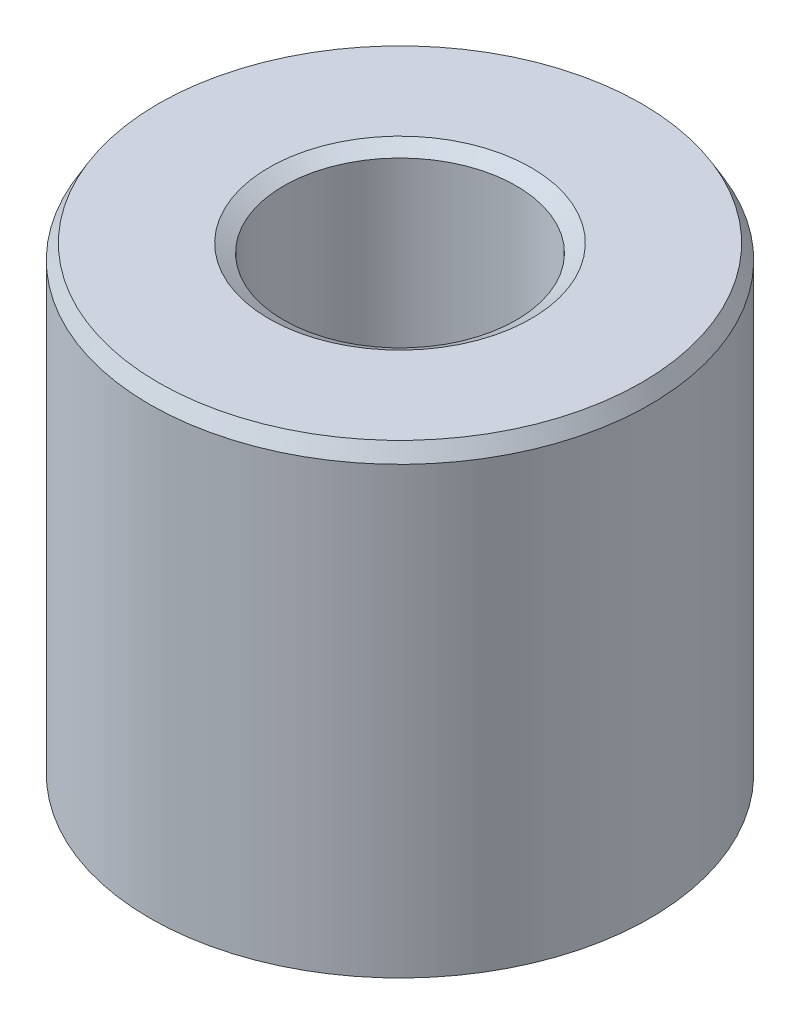
ISO-10303-21;
HEADER;
FILE_DESCRIPTION(('STEP AP214'),'2;1');
FILE_NAME('part.step','',(''),(''),'','','');
FILE_SCHEMA(('AUTOMOTIVE_DESIGN { 1 0 10303 214 1 1 1 1 }'));
ENDSEC;
DATA;
#1=APPLICATION_CONTEXT('core data for automotive mechanical design processes');
#2=APPLICATION_PROTOCOL_DEFINITION('international standard','automotive_design',2000,#1);
#3=PRODUCT_CONTEXT('',#1,'mechanical');
#4=PRODUCT('Part','Part','',(#3));
#5=PRODUCT_RELATED_PRODUCT_CATEGORY('part','',(#4));
#6=PRODUCT_DEFINITION_FORMATION('','',#4);
#7=PRODUCT_DEFINITION_CONTEXT('part definition',#1,'design');
#8=PRODUCT_DEFINITION('design','',#6,#7);
#9=PRODUCT_DEFINITION_SHAPE('','',#8);
#10=(LENGTH_UNIT() NAMED_UNIT(*) SI_UNIT(.MILLI.,.METRE.));
#11=(NAMED_UNIT(*) PLANE_ANGLE_UNIT() SI_UNIT($,.RADIAN.));
#12=(NAMED_UNIT(*) SI_UNIT($,.STERADIAN.) SOLID_ANGLE_UNIT());
#13=UNCERTAINTY_MEASURE_WITH_UNIT(LENGTH_MEASURE(1.E-05),#10,'distance_accuracy_value','');
#14=(GEOMETRIC_REPRESENTATION_CONTEXT(3) GLOBAL_UNCERTAINTY_ASSIGNED_CONTEXT((#13)) GLOBAL_UNIT_ASSIGNED_CONTEXT((#10,
#11,#12)) REPRESENTATION_CONTEXT('',''));
#15=CARTESIAN_POINT('',(0.,0.,0.));
#16=DIRECTION('',(0.,0.,1.));
#17=DIRECTION('',(1.,0.,0.));
#18=AXIS2_PLACEMENT_3D('',#15,#16,#17);
#19=CARTESIAN_POINT('',(0.,74.8606184979208,0.));
#20=DIRECTION('',(0.,-1.,0.));
#21=DIRECTION('',(0.,0.,-1.));
#22=AXIS2_PLACEMENT_3D('',#19,#20,#21);
#23=CYLINDRICAL_SURFACE('',#22,40.);
#24=CARTESIAN_POINT('',(0.,1.3616517794041,0.));
#25=DIRECTION('',(0.,1.,0.));
#26=DIRECTION('',(0.,0.,1.));
#27=AXIS2_PLACEMENT_3D('',#24,#25,#26);
#28=CIRCLE('',#27,40.);
#29=CARTESIAN_POINT('',(0.,1.3616517794041,40.));
#30=VERTEX_POINT('',#29);
#31=EDGE_CURVE('E10',#30,#30,#28,.T.);
#32=ORIENTED_EDGE('',*,*,#31,.T.);
#33=EDGE_LOOP('',(#32));
#34=FACE_BOUND('',#33,.T.);
#35=CARTESIAN_POINT('',(0.,72.5021684337763,0.));
#36=DIRECTION('',(0.,1.,0.));
#37=DIRECTION('',(0.,0.,1.));
#38=AXIS2_PLACEMENT_3D('',#35,#36,#37);
#39=CIRCLE('',#38,40.);
#40=CARTESIAN_POINT('',(0.,72.5021684337763,40.));
#41=VERTEX_POINT('',#40);
#42=EDGE_CURVE('E50',#41,#41,#39,.F.);
#43=ORIENTED_EDGE('',*,*,#42,.T.);
#44=EDGE_LOOP('',(#43));
#45=FACE_BOUND('',#44,.T.);
#46=ADVANCED_FACE('F39',(#34,#45),#23,.T.);
#47=CARTESIAN_POINT('',(0.,74.8606184979208,0.));
#48=DIRECTION('',(0.,1.,0.));
#49=DIRECTION('',(0.,0.,1.));
#50=AXIS2_PLACEMENT_3D('',#47,#48,#49);
#51=PLANE('',#50);
#52=CARTESIAN_POINT('',(0.,74.8606184979208,0.));
#53=DIRECTION('',(0.,1.,0.));
#54=DIRECTION('',(0.,0.,1.));
#55=AXIS2_PLACEMENT_3D('',#52,#53,#54);
#56=CIRCLE('',#55,20.9595914073997);
#57=CARTESIAN_POINT('',(0.,74.8606184979208,20.9595914073997));
#58=VERTEX_POINT('',#57);
#59=EDGE_CURVE('E58',#58,#58,#56,.F.);
#60=ORIENTED_EDGE('',*,*,#59,.T.);
#61=EDGE_LOOP('',(#60));
#62=FACE_BOUND('',#61,.T.);
#63=CARTESIAN_POINT('',(0.,74.8606184979208,0.));
#64=DIRECTION('',(0.,1.,0.));
#65=DIRECTION('',(0.,0.,1.));
#66=AXIS2_PLACEMENT_3D('',#63,#64,#65);
#67=CIRCLE('',#66,38.6383482205959);
#68=CARTESIAN_POINT('',(0.,74.8606184979208,38.6383482205959));
#69=VERTEX_POINT('',#68);
#70=EDGE_CURVE('E61',#69,#69,#67,.T.);
#71=ORIENTED_EDGE('',*,*,#70,.T.);
#72=EDGE_LOOP('',(#71));
#73=FACE_BOUND('',#72,.T.);
#74=ADVANCED_FACE('F88',(#62,#73),#51,.T.);
#75=CARTESIAN_POINT('',(0.,0.,0.));
#76=DIRECTION('',(0.,1.,0.));
#77=DIRECTION('',(0.,0.,1.));
#78=AXIS2_PLACEMENT_3D('',#75,#76,#77);
#79=PLANE('',#78);
#80=CARTESIAN_POINT('',(0.,0.,0.));
#81=DIRECTION('',(0.,1.,0.));
#82=DIRECTION('',(0.,0.,1.));
#83=AXIS2_PLACEMENT_3D('',#80,#81,#82);
#84=CIRCLE('',#83,19.9627931226593);
#85=CARTESIAN_POINT('',(0.,0.,19.9627931226593));
#86=VERTEX_POINT('',#85);
#87=EDGE_CURVE('E51',#86,#86,#84,.T.);
#88=ORIENTED_EDGE('',*,*,#87,.T.);
#89=EDGE_LOOP('',(#88));
#90=FACE_BOUND('',#89,.T.);
#91=CARTESIAN_POINT('',(0.,0.,0.));
#92=DIRECTION('',(0.,1.,0.));
#93=DIRECTION('',(0.,0.,1.));
#94=AXIS2_PLACEMENT_3D('',#91,#92,#93);
#95=CIRCLE('',#94,37.6415499358555);
#96=CARTESIAN_POINT('',(0.,0.,37.6415499358555));
#97=VERTEX_POINT('',#96);
#98=EDGE_CURVE('E54',#97,#97,#95,.F.);
#99=ORIENTED_EDGE('',*,*,#98,.T.);
#100=EDGE_LOOP('',(#99));
#101=FACE_BOUND('',#100,.T.);
#102=ADVANCED_FACE('F83',(#90,#101),#79,.F.);
#103=CARTESIAN_POINT('',(0.,74.8606184979208,0.));
#104=DIRECTION('',(0.,-1.,0.));
#105=DIRECTION('',(0.,0.,-1.));
#106=AXIS2_PLACEMENT_3D('',#103,#104,#105);
#107=CYLINDRICAL_SURFACE('',#106,18.6011413432552);
#108=CARTESIAN_POINT('',(0.,73.4989667185167,0.));
#109=DIRECTION('',(0.,1.,0.));
#110=DIRECTION('',(0.,0.,1.));
#111=AXIS2_PLACEMENT_3D('',#108,#109,#110);
#112=CIRCLE('',#111,18.6011413432552);
#113=CARTESIAN_POINT('',(0.,73.4989667185167,18.6011413432552));
#114=VERTEX_POINT('',#113);
#115=EDGE_CURVE('E67',#114,#114,#112,.T.);
#116=ORIENTED_EDGE('',*,*,#115,.T.);
#117=EDGE_LOOP('',(#116));
#118=FACE_BOUND('',#117,.T.);
#119=CARTESIAN_POINT('',(0.,2.35845006414447,0.));
#120=DIRECTION('',(0.,1.,0.));
#121=DIRECTION('',(0.,0.,1.));
#122=AXIS2_PLACEMENT_3D('',#119,#120,#121);
#123=CIRCLE('',#122,18.6011413432552);
#124=CARTESIAN_POINT('',(0.,2.35845006414447,18.6011413432552));
#125=VERTEX_POINT('',#124);
#126=EDGE_CURVE('E69',#125,#125,#123,.F.);
#127=ORIENTED_EDGE('',*,*,#126,.T.);
#128=EDGE_LOOP('',(#127));
#129=FACE_BOUND('',#128,.T.);
#130=ADVANCED_FACE('F71',(#118,#129),#107,.F.);
#131=CARTESIAN_POINT('',(0.,73.4989667185167,0.));
#132=DIRECTION('',(0.,1.,0.));
#133=DIRECTION('',(0.,0.,1.));
#134=AXIS2_PLACEMENT_3D('',#131,#132,#133);
#135=CONICAL_SURFACE('',#134,18.6011413432552,1.0471975511966);
#136=CARTESIAN_POINT('',(0.,74.8606184979208,20.9595914073997));
#137=CARTESIAN_POINT('',(0.,74.8464346252187,20.9350242192316));
#138=CARTESIAN_POINT('',(0.,74.8322507525166,20.9104570310634));
#139=CARTESIAN_POINT('',(0.,74.8038830071123,20.861322654727));
#140=CARTESIAN_POINT('',(0.,74.7896991344102,20.8367554665589));
#141=CARTESIAN_POINT('',(0.,74.7613313890059,20.7876210902225));
#142=CARTESIAN_POINT('',(0.,74.7471475163038,20.7630539020544));
#143=CARTESIAN_POINT('',(0.,74.7187797708995,20.713919525718));
#144=CARTESIAN_POINT('',(0.,74.7045958981974,20.6893523375498));
#145=CARTESIAN_POINT('',(0.,74.6762281527932,20.6402179612135));
#146=CARTESIAN_POINT('',(0.,74.6620442800911,20.6156507730453));
#147=CARTESIAN_POINT('',(0.,74.6336765346868,20.566516396709));
#148=CARTESIAN_POINT('',(0.,74.6194926619847,20.5419492085408));
#149=CARTESIAN_POINT('',(0.,74.5911249165804,20.4928148322045));
#150=CARTESIAN_POINT('',(0.,74.5769410438783,20.4682476440363));
#151=CARTESIAN_POINT('',(0.,74.548573298474,20.4191132676999));
#152=CARTESIAN_POINT('',(0.,74.5343894257719,20.3945460795318));
#153=CARTESIAN_POINT('',(0.,74.5060216803677,20.3454117031954));
#154=CARTESIAN_POINT('',(0.,74.4918378076655,20.3208445150273));
#155=CARTESIAN_POINT('',(0.,74.4634700622613,20.2717101386909));
#156=CARTESIAN_POINT('',(0.,74.4492861895591,20.2471429505227));
#157=CARTESIAN_POINT('',(0.,74.4209184441549,20.1980085741864));
#158=CARTESIAN_POINT('',(0.,74.4067345714528,20.1734413860182));
#159=CARTESIAN_POINT('',(0.,74.3783668260485,20.1243070096819));
#160=CARTESIAN_POINT('',(0.,74.3641829533464,20.0997398215137));
#161=CARTESIAN_POINT('',(0.,74.3358152079421,20.0506054451774));
#162=CARTESIAN_POINT('',(0.,74.32163133524,20.0260382570092));
#163=CARTESIAN_POINT('',(0.,74.2932635898358,19.9769038806729));
#164=CARTESIAN_POINT('',(0.,74.2790797171337,19.9523366925047));
#165=CARTESIAN_POINT('',(0.,74.2507119717294,19.9032023161683));
#166=CARTESIAN_POINT('',(0.,74.2365280990273,19.8786351280002));
#167=CARTESIAN_POINT('',(0.,74.208160353623,19.8295007516638));
#168=CARTESIAN_POINT('',(0.,74.1939764809209,19.8049335634956));
#169=CARTESIAN_POINT('',(0.,74.1656087355166,19.7557991871593));
#170=CARTESIAN_POINT('',(0.,74.1514248628145,19.7312319989911));
#171=CARTESIAN_POINT('',(0.,74.1230571174103,19.6820976226548));
#172=CARTESIAN_POINT('',(0.,74.1088732447081,19.6575304344866));
#173=CARTESIAN_POINT('',(0.,74.0805054993039,19.6083960581503));
#174=CARTESIAN_POINT('',(0.,74.0663216266017,19.5838288699821));
#175=CARTESIAN_POINT('',(0.,74.0379538811975,19.5346944936458));
#176=CARTESIAN_POINT('',(0.,74.0237700084954,19.5101273054776));
#177=CARTESIAN_POINT('',(0.,73.9954022630911,19.4609929291412));
#178=CARTESIAN_POINT('',(0.,73.981218390389,19.4364257409731));
#179=CARTESIAN_POINT('',(0.,73.9528506449847,19.3872913646367));
#180=CARTESIAN_POINT('',(0.,73.9386667722826,19.3627241764686));
#181=CARTESIAN_POINT('',(0.,73.9102990268784,19.3135898001322));
#182=CARTESIAN_POINT('',(0.,73.8961151541762,19.289022611964));
#183=CARTESIAN_POINT('',(0.,73.867747408772,19.2398882356277));
#184=CARTESIAN_POINT('',(0.,73.8535635360699,19.2153210474595));
#185=CARTESIAN_POINT('',(0.,73.8251957906656,19.1661866711232));
#186=CARTESIAN_POINT('',(0.,73.8110119179635,19.141619482955));
#187=CARTESIAN_POINT('',(0.,73.7826441725592,19.0924851066187));
#188=CARTESIAN_POINT('',(0.,73.7684602998571,19.0679179184505));
#189=CARTESIAN_POINT('',(0.,73.7400925544529,19.0187835421142));
#190=CARTESIAN_POINT('',(0.,73.7259086817507,18.994216353946));
#191=CARTESIAN_POINT('',(0.,73.6975409363465,18.9450819776096));
#192=CARTESIAN_POINT('',(0.,73.6833570636444,18.9205147894415));
#193=CARTESIAN_POINT('',(0.,73.6549893182401,18.8713804131051));
#194=CARTESIAN_POINT('',(0.,73.640805445538,18.8468132249369));
#195=CARTESIAN_POINT('',(0.,73.6124377001337,18.7976788486006));
#196=CARTESIAN_POINT('',(0.,73.5982538274316,18.7731116604324));
#197=CARTESIAN_POINT('',(0.,73.5698860820273,18.7239772840961));
#198=CARTESIAN_POINT('',(0.,73.5557022093252,18.6994100959279));
#199=CARTESIAN_POINT('',(0.,73.527334463921,18.6502757195916));
#200=CARTESIAN_POINT('',(0.,73.5131505912188,18.6257085314234));
#201=CARTESIAN_POINT('',(0.,73.4989667185167,18.6011413432552));
#202=B_SPLINE_CURVE_WITH_KNOTS('',3,(#136,#137,#138,#139,#140,#141,#142,#143,#144,#145,#146,
#147,#148,#149,#150,#151,#152,#153,#154,#155,#156,#157,#158,#159,#160,#161,#162,#163,#164,#165,
#166,#167,#168,#169,#170,#171,#172,#173,#174,#175,#176,#177,#178,#179,#180,#181,#182,#183,#184,
#185,#186,#187,#188,#189,#190,#191,#192,#193,#194,#195,#196,#197,#198,#199,#200,#201),
.UNSPECIFIED.,.F.,.F.,(4,2,2,2,2,2,2,2,2,2,2,2,2,2,2,2,2,2,2,2,2,2,2,2,2,2,2,2,2,2,2,2,4),(0.,
0.0851032362127611,0.170206472425518,0.255309708638279,0.340412944851034,0.425516181063788,
0.510619417276549,0.595722653489303,0.680825889702057,0.765929125914821,0.851032362127575,
0.936135598340329,1.02123883455309,1.10634207076584,1.1914453069786,1.27654854319136,
1.36165177940412,1.44675501561687,1.53185825182963,1.61696148804239,1.70206472425514,
1.7871679604679,1.87227119668066,1.95737443289341,2.04247766910617,2.12758090531893,
2.21268414153169,2.29778737774445,2.3828906139572,2.46799385016996,2.55309708638272,
2.63820032259547,2.72330355880823),.UNSPECIFIED.);
#203=EDGE_CURVE('BSEAM77',#58,#114,#202,.T.);
#204=ORIENTED_EDGE('',*,*,#59,.F.);
#205=ORIENTED_EDGE('',*,*,#115,.F.);
#206=ORIENTED_EDGE('',*,*,#203,.T.);
#207=ORIENTED_EDGE('',*,*,#203,.F.);
#208=EDGE_LOOP('',(#204,#206,#205,#207));
#209=FACE_BOUND('',#208,.T.);
#210=ADVANCED_FACE('F77',(#209),#135,.F.);
#211=CARTESIAN_POINT('',(0.,0.,0.));
#212=DIRECTION('',(0.,-1.,0.));
#213=DIRECTION('',(0.,0.,-1.));
#214=AXIS2_PLACEMENT_3D('',#211,#212,#213);
#215=CONICAL_SURFACE('',#214,19.9627931226593,0.523598775598299);
#216=ORIENTED_EDGE('',*,*,#126,.F.);
#217=EDGE_LOOP('',(#216));
#218=FACE_BOUND('',#217,.T.);
#219=ORIENTED_EDGE('',*,*,#87,.F.);
#220=EDGE_LOOP('',(#219));
#221=FACE_BOUND('',#220,.T.);
#222=ADVANCED_FACE('F73',(#218,#221),#215,.F.);
#223=CARTESIAN_POINT('',(0.,1.3616517794041,0.));
#224=DIRECTION('',(0.,1.,0.));
#225=DIRECTION('',(0.,0.,1.));
#226=AXIS2_PLACEMENT_3D('',#223,#224,#225);
#227=CONICAL_SURFACE('',#226,40.,1.0471975511966);
#228=CARTESIAN_POINT('',(0.,0.,37.6415499358555));
#229=CARTESIAN_POINT('',(0.,0.0141838727021258,37.6661171240237));
#230=CARTESIAN_POINT('',(0.,0.0283677454042519,37.6906843121919));
#231=CARTESIAN_POINT('',(0.,0.056735490808504,37.7398186885282));
#232=CARTESIAN_POINT('',(0.,0.0709193635106301,37.7643858766964));
#233=CARTESIAN_POINT('',(0.,0.0992871089148822,37.8135202530327));
#234=CARTESIAN_POINT('',(0.,0.113470981617008,37.8380874412009));
#235=CARTESIAN_POINT('',(0.,0.14183872702126,37.8872218175372));
#236=CARTESIAN_POINT('',(0.,0.156022599723387,37.9117890057054));
#237=CARTESIAN_POINT('',(0.,0.184390345127639,37.9609233820418));
#238=CARTESIAN_POINT('',(0.,0.198574217829765,37.9854905702099));
#239=CARTESIAN_POINT('',(0.,0.226941963234017,38.0346249465463));
#240=CARTESIAN_POINT('',(0.,0.241125835936143,38.0591921347144));
#241=CARTESIAN_POINT('',(0.,0.269493581340395,38.1083265110508));
#242=CARTESIAN_POINT('',(0.,0.283677454042521,38.132893699219));
#243=CARTESIAN_POINT('',(0.,0.312045199446773,38.1820280755553));
#244=CARTESIAN_POINT('',(0.,0.326229072148899,38.2065952637235));
#245=CARTESIAN_POINT('',(0.,0.354596817553151,38.2557296400598));
#246=CARTESIAN_POINT('',(0.,0.368780690255277,38.280296828228));
#247=CARTESIAN_POINT('',(0.,0.39714843565953,38.3294312045643));
#248=CARTESIAN_POINT('',(0.,0.411332308361656,38.3539983927325));
#249=CARTESIAN_POINT('',(0.,0.439700053765908,38.4031327690688));
#250=CARTESIAN_POINT('',(0.,0.453883926468034,38.427699957237));
#251=CARTESIAN_POINT('',(0.,0.482251671872286,38.4768343335734));
#252=CARTESIAN_POINT('',(0.,0.496435544574411,38.5014015217415));
#253=CARTESIAN_POINT('',(0.,0.524803289978664,38.5505358980779));
#254=CARTESIAN_POINT('',(0.,0.538987162680791,38.575103086246));
#255=CARTESIAN_POINT('',(0.,0.567354908085043,38.6242374625824));
#256=CARTESIAN_POINT('',(0.,0.581538780787169,38.6488046507506));
#257=CARTESIAN_POINT('',(0.,0.60990652619142,38.6979390270869));
#258=CARTESIAN_POINT('',(0.,0.624090398893547,38.7225062152551));
#259=CARTESIAN_POINT('',(0.,0.652458144297799,38.7716405915914));
#260=CARTESIAN_POINT('',(0.,0.666642016999925,38.7962077797596));
#261=CARTESIAN_POINT('',(0.,0.695009762404177,38.8453421560959));
#262=CARTESIAN_POINT('',(0.,0.709193635106303,38.8699093442641));
#263=CARTESIAN_POINT('',(0.,0.737561380510555,38.9190437206004));
#264=CARTESIAN_POINT('',(0.,0.751745253212681,38.9436109087686));
#265=CARTESIAN_POINT('',(0.,0.780112998616933,38.992745285105));
#266=CARTESIAN_POINT('',(0.,0.794296871319059,39.0173124732731));
#267=CARTESIAN_POINT('',(0.,0.822664616723311,39.0664468496095));
#268=CARTESIAN_POINT('',(0.,0.836848489425438,39.0910140377776));
#269=CARTESIAN_POINT('',(0.,0.86521623482969,39.140148414114));
#270=CARTESIAN_POINT('',(0.,0.879400107531816,39.1647156022822));
#271=CARTESIAN_POINT('',(0.,0.907767852936068,39.2138499786185));
#272=CARTESIAN_POINT('',(0.,0.921951725638194,39.2384171667867));
#273=CARTESIAN_POINT('',(0.,0.950319471042446,39.287551543123));
#274=CARTESIAN_POINT('',(0.,0.964503343744572,39.3121187312912));
#275=CARTESIAN_POINT('',(0.,0.992871089148824,39.3612531076275));
#276=CARTESIAN_POINT('',(0.,1.00705496185095,39.3858202957957));
#277=CARTESIAN_POINT('',(0.,1.0354227072552,39.4349546721321));
#278=CARTESIAN_POINT('',(0.,1.04960657995733,39.4595218603002));
#279=CARTESIAN_POINT('',(0.,1.07797432536158,39.5086562366366));
#280=CARTESIAN_POINT('',(0.,1.09215819806371,39.5332234248047));
#281=CARTESIAN_POINT('',(0.,1.12052594346796,39.5823578011411));
#282=CARTESIAN_POINT('',(0.,1.13470981617008,39.6069249893093));
#283=CARTESIAN_POINT('',(0.,1.16307756157434,39.6560593656456));
#284=CARTESIAN_POINT('',(0.,1.17726143427646,39.6806265538138));
#285=CARTESIAN_POINT('',(0.,1.20562917968072,39.7297609301501));
#286=CARTESIAN_POINT('',(0.,1.21981305238284,39.7543281183183));
#287=CARTESIAN_POINT('',(0.,1.24818079778709,39.8034624946546));
#288=CARTESIAN_POINT('',(0.,1.26236467048922,39.8280296828228));
#289=CARTESIAN_POINT('',(0.,1.29073241589347,39.8771640591591));
#290=CARTESIAN_POINT('',(0.,1.3049162885956,39.9017312473273));
#291=CARTESIAN_POINT('',(0.,1.33328403399985,39.9508656236637));
#292=CARTESIAN_POINT('',(0.,1.34746790670198,39.9754328118318));
#293=CARTESIAN_POINT('',(0.,1.3616517794041,40.));
#294=B_SPLINE_CURVE_WITH_KNOTS('',3,(#228,#229,#230,#231,#232,#233,#234,#235,#236,#237,#238,
#239,#240,#241,#242,#243,#244,#245,#246,#247,#248,#249,#250,#251,#252,#253,#254,#255,#256,#257,
#258,#259,#260,#261,#262,#263,#264,#265,#266,#267,#268,#269,#270,#271,#272,#273,#274,#275,#276,
#277,#278,#279,#280,#281,#282,#283,#284,#285,#286,#287,#288,#289,#290,#291,#292,#293),
.UNSPECIFIED.,.F.,.F.,(4,2,2,2,2,2,2,2,2,2,2,2,2,2,2,2,2,2,2,2,2,2,2,2,2,2,2,2,2,2,2,2,4),(0.,
0.0851032362127565,0.170206472425513,0.25530970863827,0.340412944851026,0.425516181063783,
0.510619417276539,0.595722653489296,0.680825889702052,0.765929125914809,0.851032362127565,
0.936135598340322,1.02123883455308,1.10634207076583,1.19144530697859,1.27654854319134,
1.3616517794041,1.44675501561686,1.53185825182961,1.61696148804237,1.70206472425513,
1.78716796046788,1.87227119668064,1.95737443289339,2.04247766910615,2.12758090531891,
2.21268414153166,2.29778737774442,2.38289061395718,2.46799385016993,2.55309708638269,
2.63820032259545,2.7233035588082),.UNSPECIFIED.);
#295=EDGE_CURVE('BSEAM76',#97,#30,#294,.T.);
#296=ORIENTED_EDGE('',*,*,#98,.F.);
#297=ORIENTED_EDGE('',*,*,#31,.F.);
#298=ORIENTED_EDGE('',*,*,#295,.T.);
#299=ORIENTED_EDGE('',*,*,#295,.F.);
#300=EDGE_LOOP('',(#296,#298,#297,#299));
#301=FACE_BOUND('',#300,.T.);
#302=ADVANCED_FACE('F76',(#301),#227,.T.);
#303=CARTESIAN_POINT('',(0.,74.8606184979208,0.));
#304=DIRECTION('',(0.,-1.,0.));
#305=DIRECTION('',(0.,0.,-1.));
#306=AXIS2_PLACEMENT_3D('',#303,#304,#305);
#307=CONICAL_SURFACE('',#306,38.6383482205959,0.523598775598294);
#308=ORIENTED_EDGE('',*,*,#42,.F.);
#309=EDGE_LOOP('',(#308));
#310=FACE_BOUND('',#309,.T.);
#311=ORIENTED_EDGE('',*,*,#70,.F.);
#312=EDGE_LOOP('',(#311));
#313=FACE_BOUND('',#312,.T.);
#314=ADVANCED_FACE('F45',(#310,#313),#307,.T.);
#315=CLOSED_SHELL('',(#46,#74,#102,#130,#210,#222,#302,#314));
#316=MANIFOLD_SOLID_BREP('B2',#315);
#317=ADVANCED_BREP_SHAPE_REPRESENTATION('',(#18,#316),#14);
#318=SHAPE_DEFINITION_REPRESENTATION(#9,#317);
ENDSEC;
END-ISO-10303-21;
